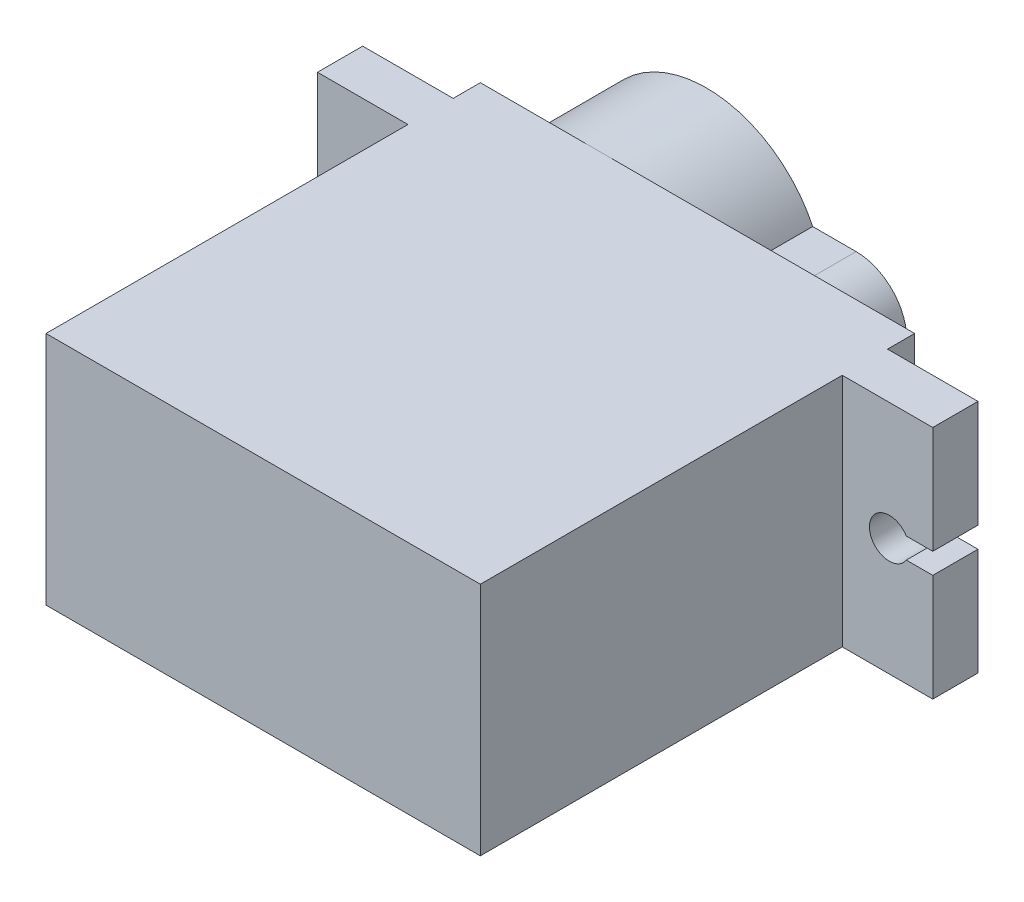
ISO-10303-21;
HEADER;
FILE_DESCRIPTION(('STEP AP214'),'2;1');
FILE_NAME('part.step','',(''),(''),'','','');
FILE_SCHEMA(('AUTOMOTIVE_DESIGN { 1 0 10303 214 1 1 1 1 }'));
ENDSEC;
DATA;
#1=APPLICATION_CONTEXT('core data for automotive mechanical design processes');
#2=APPLICATION_PROTOCOL_DEFINITION('international standard','automotive_design',2000,#1);
#3=PRODUCT_CONTEXT('',#1,'mechanical');
#4=PRODUCT('Part','Part','',(#3));
#5=PRODUCT_RELATED_PRODUCT_CATEGORY('part','',(#4));
#6=PRODUCT_DEFINITION_FORMATION('','',#4);
#7=PRODUCT_DEFINITION_CONTEXT('part definition',#1,'design');
#8=PRODUCT_DEFINITION('design','',#6,#7);
#9=PRODUCT_DEFINITION_SHAPE('','',#8);
#10=(LENGTH_UNIT() NAMED_UNIT(*) SI_UNIT(.MILLI.,.METRE.));
#11=(NAMED_UNIT(*) PLANE_ANGLE_UNIT() SI_UNIT($,.RADIAN.));
#12=(NAMED_UNIT(*) SI_UNIT($,.STERADIAN.) SOLID_ANGLE_UNIT());
#13=UNCERTAINTY_MEASURE_WITH_UNIT(LENGTH_MEASURE(1.E-05),#10,'distance_accuracy_value','');
#14=(GEOMETRIC_REPRESENTATION_CONTEXT(3) GLOBAL_UNCERTAINTY_ASSIGNED_CONTEXT((#13)) GLOBAL_UNIT_ASSIGNED_CONTEXT((#10,
#11,#12)) REPRESENTATION_CONTEXT('',''));
#15=CARTESIAN_POINT('',(0.,0.,0.));
#16=DIRECTION('',(0.,0.,1.));
#17=DIRECTION('',(1.,0.,0.));
#18=AXIS2_PLACEMENT_3D('',#15,#16,#17);
#19=CARTESIAN_POINT('',(0.,0.,0.));
#20=DIRECTION('',(0.,0.,-1.));
#21=DIRECTION('',(-1.,0.,0.));
#22=AXIS2_PLACEMENT_3D('',#19,#20,#21);
#23=PLANE('',#22);
#24=CARTESIAN_POINT('',(6.5,6.5,0.));
#25=DIRECTION('',(0.,0.,-1.));
#26=DIRECTION('',(-1.,0.,0.));
#27=AXIS2_PLACEMENT_3D('',#24,#25,#26);
#28=CIRCLE('',#27,6.5);
#29=CARTESIAN_POINT('',(0.,6.5,0.));
#30=VERTEX_POINT('',#29);
#31=CARTESIAN_POINT('',(6.5,13.,0.));
#32=VERTEX_POINT('',#31);
#33=EDGE_CURVE('E11',#30,#32,#28,.T.);
#34=ORIENTED_EDGE('',*,*,#33,.F.);
#35=DIRECTION('',(0.,-1.,0.));
#36=VECTOR('',#35,1.);
#37=CARTESIAN_POINT('',(0.,0.,0.));
#38=LINE('',#37,#36);
#39=CARTESIAN_POINT('',(0.,13.,0.));
#40=VERTEX_POINT('',#39);
#41=EDGE_CURVE('E436',#40,#30,#38,.T.);
#42=ORIENTED_EDGE('',*,*,#41,.F.);
#43=DIRECTION('',(-1.,0.,0.));
#44=VECTOR('',#43,1.);
#45=CARTESIAN_POINT('',(0.,13.,0.));
#46=LINE('',#45,#44);
#47=EDGE_CURVE('E449',#32,#40,#46,.T.);
#48=ORIENTED_EDGE('',*,*,#47,.F.);
#49=EDGE_LOOP('',(#34,#42,#48));
#50=FACE_BOUND('',#49,.T.);
#51=ADVANCED_FACE('F39',(#50),#23,.T.);
#52=CARTESIAN_POINT('',(12.366003750425,9.30000000000001,0.));
#53=VERTEX_POINT('',#52);
#54=EDGE_CURVE('E49',#32,#53,#28,.T.);
#55=ORIENTED_EDGE('',*,*,#54,.F.);
#56=CARTESIAN_POINT('',(24.,13.,0.));
#57=VERTEX_POINT('',#56);
#58=EDGE_CURVE('E426',#57,#32,#46,.T.);
#59=ORIENTED_EDGE('',*,*,#58,.F.);
#60=DIRECTION('',(0.,1.,0.));
#61=VECTOR('',#60,1.);
#62=CARTESIAN_POINT('',(24.,0.,0.));
#63=LINE('',#62,#61);
#64=CARTESIAN_POINT('',(24.,0.,0.));
#65=VERTEX_POINT('',#64);
#66=EDGE_CURVE('E445',#65,#57,#63,.T.);
#67=ORIENTED_EDGE('',*,*,#66,.F.);
#68=DIRECTION('',(1.,0.,0.));
#69=VECTOR('',#68,1.);
#70=CARTESIAN_POINT('',(0.,0.,0.));
#71=LINE('',#70,#69);
#72=CARTESIAN_POINT('',(6.5,0.,0.));
#73=VERTEX_POINT('',#72);
#74=EDGE_CURVE('E440',#73,#65,#71,.T.);
#75=ORIENTED_EDGE('',*,*,#74,.F.);
#76=CARTESIAN_POINT('',(12.366003750425,3.7,0.));
#77=VERTEX_POINT('',#76);
#78=EDGE_CURVE('E51',#77,#73,#28,.T.);
#79=ORIENTED_EDGE('',*,*,#78,.F.);
#80=DIRECTION('',(-1.,0.,0.));
#81=VECTOR('',#80,1.);
#82=CARTESIAN_POINT('',(14.7658073053947,3.7,0.));
#83=LINE('',#82,#81);
#84=CARTESIAN_POINT('',(14.7658073053947,3.7,0.));
#85=VERTEX_POINT('',#84);
#86=EDGE_CURVE('E486',#85,#77,#83,.T.);
#87=ORIENTED_EDGE('',*,*,#86,.F.);
#88=CARTESIAN_POINT('',(14.7658073053947,6.5,0.));
#89=DIRECTION('',(0.,0.,-1.));
#90=DIRECTION('',(-1.,0.,0.));
#91=AXIS2_PLACEMENT_3D('',#88,#89,#90);
#92=CIRCLE('',#91,2.8);
#93=CARTESIAN_POINT('',(14.7658073053947,9.3,0.));
#94=VERTEX_POINT('',#93);
#95=EDGE_CURVE('E63',#94,#85,#92,.T.);
#96=ORIENTED_EDGE('',*,*,#95,.F.);
#97=DIRECTION('',(1.,0.,0.));
#98=VECTOR('',#97,1.);
#99=CARTESIAN_POINT('',(12.366003750425,9.3,0.));
#100=LINE('',#99,#98);
#101=EDGE_CURVE('E58',#53,#94,#100,.T.);
#102=ORIENTED_EDGE('',*,*,#101,.F.);
#103=EDGE_LOOP('',(#55,#59,#67,#75,#79,#87,#96,#102));
#104=FACE_BOUND('',#103,.T.);
#105=ADVANCED_FACE('F524',(#104),#23,.T.);
#106=CARTESIAN_POINT('',(29.,13.,4.));
#107=DIRECTION('',(-1.,0.,0.));
#108=DIRECTION('',(0.,0.,1.));
#109=AXIS2_PLACEMENT_3D('',#106,#107,#108);
#110=PLANE('',#109);
#111=DIRECTION('',(0.,0.,-1.));
#112=VECTOR('',#111,1.);
#113=CARTESIAN_POINT('',(29.,7.07476473315433,5.));
#114=LINE('',#113,#112);
#115=CARTESIAN_POINT('',(29.,7.07476473315433,4.));
#116=VERTEX_POINT('',#115);
#117=CARTESIAN_POINT('',(29.,7.07476473315433,1.5));
#118=VERTEX_POINT('',#117);
#119=EDGE_CURVE('E275',#116,#118,#114,.T.);
#120=ORIENTED_EDGE('',*,*,#119,.T.);
#121=DIRECTION('',(0.,1.,0.));
#122=VECTOR('',#121,1.);
#123=CARTESIAN_POINT('',(29.,13.,1.5));
#124=LINE('',#123,#122);
#125=CARTESIAN_POINT('',(29.,13.,1.5));
#126=VERTEX_POINT('',#125);
#127=EDGE_CURVE('E381',#118,#126,#124,.T.);
#128=ORIENTED_EDGE('',*,*,#127,.T.);
#129=DIRECTION('',(0.,0.,-1.));
#130=VECTOR('',#129,1.);
#131=CARTESIAN_POINT('',(29.,13.,4.));
#132=LINE('',#131,#130);
#133=CARTESIAN_POINT('',(29.,13.,4.));
#134=VERTEX_POINT('',#133);
#135=EDGE_CURVE('E394',#134,#126,#132,.T.);
#136=ORIENTED_EDGE('',*,*,#135,.F.);
#137=DIRECTION('',(0.,1.,0.));
#138=VECTOR('',#137,1.);
#139=CARTESIAN_POINT('',(29.,13.,4.));
#140=LINE('',#139,#138);
#141=EDGE_CURVE('E361',#116,#134,#140,.T.);
#142=ORIENTED_EDGE('',*,*,#141,.F.);
#143=EDGE_LOOP('',(#120,#128,#136,#142));
#144=FACE_BOUND('',#143,.T.);
#145=ADVANCED_FACE('F531',(#144),#110,.F.);
#146=CARTESIAN_POINT('',(0.,0.,4.));
#147=DIRECTION('',(0.,0.,1.));
#148=DIRECTION('',(1.,0.,0.));
#149=AXIS2_PLACEMENT_3D('',#146,#147,#148);
#150=PLANE('',#149);
#151=CARTESIAN_POINT('',(-2.6,6.5,4.));
#152=DIRECTION('',(0.,0.,1.));
#153=DIRECTION('',(1.,0.,0.));
#154=AXIS2_PLACEMENT_3D('',#151,#152,#153);
#155=CIRCLE('',#154,1.1);
#156=CARTESIAN_POINT('',(-3.53789418460828,7.07476473315433,4.));
#157=VERTEX_POINT('',#156);
#158=CARTESIAN_POINT('',(-3.53789418460829,5.92523526684567,4.));
#159=VERTEX_POINT('',#158);
#160=EDGE_CURVE('E304',#157,#159,#155,.F.);
#161=ORIENTED_EDGE('',*,*,#160,.T.);
#162=DIRECTION('',(-1.,0.,0.));
#163=VECTOR('',#162,1.);
#164=CARTESIAN_POINT('',(0.,5.92523526684567,4.));
#165=LINE('',#164,#163);
#166=CARTESIAN_POINT('',(-5.,5.92523526684567,4.));
#167=VERTEX_POINT('',#166);
#168=EDGE_CURVE('E300',#159,#167,#165,.T.);
#169=ORIENTED_EDGE('',*,*,#168,.T.);
#170=DIRECTION('',(0.,-1.,0.));
#171=VECTOR('',#170,1.);
#172=CARTESIAN_POINT('',(-5.00000000000001,13.,4.));
#173=LINE('',#172,#171);
#174=CARTESIAN_POINT('',(-5.,0.,4.));
#175=VERTEX_POINT('',#174);
#176=EDGE_CURVE('E356',#167,#175,#173,.T.);
#177=ORIENTED_EDGE('',*,*,#176,.T.);
#178=DIRECTION('',(1.,0.,0.));
#179=VECTOR('',#178,1.);
#180=CARTESIAN_POINT('',(-5.,0.,4.));
#181=LINE('',#180,#179);
#182=CARTESIAN_POINT('',(0.,0.,4.));
#183=VERTEX_POINT('',#182);
#184=EDGE_CURVE('E357',#175,#183,#181,.T.);
#185=ORIENTED_EDGE('',*,*,#184,.T.);
#186=DIRECTION('',(0.,-1.,0.));
#187=VECTOR('',#186,1.);
#188=CARTESIAN_POINT('',(0.,0.,4.));
#189=LINE('',#188,#187);
#190=CARTESIAN_POINT('',(0.,13.,4.));
#191=VERTEX_POINT('',#190);
#192=EDGE_CURVE('E417',#191,#183,#189,.T.);
#193=ORIENTED_EDGE('',*,*,#192,.F.);
#194=DIRECTION('',(-1.,0.,0.));
#195=VECTOR('',#194,1.);
#196=CARTESIAN_POINT('',(-5.00000000000001,13.,4.));
#197=LINE('',#196,#195);
#198=CARTESIAN_POINT('',(-5.00000000000001,13.,4.));
#199=VERTEX_POINT('',#198);
#200=EDGE_CURVE('E366',#191,#199,#197,.T.);
#201=ORIENTED_EDGE('',*,*,#200,.T.);
#202=CARTESIAN_POINT('',(-5.00000000000001,7.07476473315433,4.));
#203=VERTEX_POINT('',#202);
#204=EDGE_CURVE('E351',#199,#203,#173,.T.);
#205=ORIENTED_EDGE('',*,*,#204,.T.);
#206=DIRECTION('',(-1.,0.,0.));
#207=VECTOR('',#206,1.);
#208=CARTESIAN_POINT('',(0.,7.07476473315433,4.));
#209=LINE('',#208,#207);
#210=EDGE_CURVE('E274',#157,#203,#209,.T.);
#211=ORIENTED_EDGE('',*,*,#210,.F.);
#212=EDGE_LOOP('',(#161,#169,#177,#185,#193,#201,#205,#211));
#213=FACE_BOUND('',#212,.T.);
#214=ADVANCED_FACE('F587',(#213),#150,.T.);
#215=CARTESIAN_POINT('',(0.,0.,1.5));
#216=DIRECTION('',(0.,0.,1.));
#217=DIRECTION('',(1.,0.,0.));
#218=AXIS2_PLACEMENT_3D('',#215,#216,#217);
#219=PLANE('',#218);
#220=CARTESIAN_POINT('',(-2.6,3.,1.5));
#221=DIRECTION('',(0.,0.,-1.));
#222=DIRECTION('',(-1.,0.,0.));
#223=AXIS2_PLACEMENT_3D('',#220,#221,#222);
#224=CIRCLE('',#223,1.09999999999999);
#225=CARTESIAN_POINT('',(-3.69999999999999,3.,1.5));
#226=VERTEX_POINT('',#225);
#227=EDGE_CURVE('E326',#226,#226,#224,.T.);
#228=ORIENTED_EDGE('',*,*,#227,.F.);
#229=EDGE_LOOP('',(#228));
#230=FACE_BOUND('',#229,.T.);
#231=CARTESIAN_POINT('',(-2.6,10.,1.5));
#232=DIRECTION('',(0.,0.,-1.));
#233=DIRECTION('',(-1.,0.,0.));
#234=AXIS2_PLACEMENT_3D('',#231,#232,#233);
#235=CIRCLE('',#234,1.09999999999999);
#236=CARTESIAN_POINT('',(-3.69999999999999,10.,1.5));
#237=VERTEX_POINT('',#236);
#238=EDGE_CURVE('E318',#237,#237,#235,.T.);
#239=ORIENTED_EDGE('',*,*,#238,.F.);
#240=EDGE_LOOP('',(#239));
#241=FACE_BOUND('',#240,.T.);
#242=DIRECTION('',(1.,0.,0.));
#243=VECTOR('',#242,1.);
#244=CARTESIAN_POINT('',(-5.,5.92523526684567,1.5));
#245=LINE('',#244,#243);
#246=CARTESIAN_POINT('',(-5.,5.92523526684567,1.5));
#247=VERTEX_POINT('',#246);
#248=CARTESIAN_POINT('',(-3.53789418460829,5.92523526684567,1.5));
#249=VERTEX_POINT('',#248);
#250=EDGE_CURVE('E262',#247,#249,#245,.T.);
#251=ORIENTED_EDGE('',*,*,#250,.T.);
#252=CARTESIAN_POINT('',(-2.6,6.5,1.5));
#253=DIRECTION('',(0.,0.,1.));
#254=DIRECTION('',(1.,0.,0.));
#255=AXIS2_PLACEMENT_3D('',#252,#253,#254);
#256=CIRCLE('',#255,1.1);
#257=CARTESIAN_POINT('',(-3.53789418460828,7.07476473315433,1.5));
#258=VERTEX_POINT('',#257);
#259=EDGE_CURVE('E291',#249,#258,#256,.T.);
#260=ORIENTED_EDGE('',*,*,#259,.T.);
#261=DIRECTION('',(1.,0.,0.));
#262=VECTOR('',#261,1.);
#263=CARTESIAN_POINT('',(-5.,7.07476473315433,1.5));
#264=LINE('',#263,#262);
#265=CARTESIAN_POINT('',(-5.,7.07476473315433,1.5));
#266=VERTEX_POINT('',#265);
#267=EDGE_CURVE('E287',#266,#258,#264,.T.);
#268=ORIENTED_EDGE('',*,*,#267,.F.);
#269=DIRECTION('',(0.,-1.,0.));
#270=VECTOR('',#269,1.);
#271=CARTESIAN_POINT('',(-5.00000000000001,13.,1.5));
#272=LINE('',#271,#270);
#273=CARTESIAN_POINT('',(-5.00000000000001,13.,1.5));
#274=VERTEX_POINT('',#273);
#275=EDGE_CURVE('E372',#274,#266,#272,.T.);
#276=ORIENTED_EDGE('',*,*,#275,.F.);
#277=DIRECTION('',(-1.,0.,0.));
#278=VECTOR('',#277,1.);
#279=CARTESIAN_POINT('',(-5.00000000000001,13.,1.5));
#280=LINE('',#279,#278);
#281=CARTESIAN_POINT('',(0.,13.,1.5));
#282=VERTEX_POINT('',#281);
#283=EDGE_CURVE('E386',#282,#274,#280,.T.);
#284=ORIENTED_EDGE('',*,*,#283,.F.);
#285=DIRECTION('',(0.,-1.,0.));
#286=VECTOR('',#285,1.);
#287=CARTESIAN_POINT('',(0.,0.,1.5));
#288=LINE('',#287,#286);
#289=CARTESIAN_POINT('',(0.,0.,1.5));
#290=VERTEX_POINT('',#289);
#291=EDGE_CURVE('E410',#282,#290,#288,.T.);
#292=ORIENTED_EDGE('',*,*,#291,.T.);
#293=DIRECTION('',(1.,0.,0.));
#294=VECTOR('',#293,1.);
#295=CARTESIAN_POINT('',(-5.,0.,1.5));
#296=LINE('',#295,#294);
#297=CARTESIAN_POINT('',(-5.,0.,1.5));
#298=VERTEX_POINT('',#297);
#299=EDGE_CURVE('E377',#298,#290,#296,.T.);
#300=ORIENTED_EDGE('',*,*,#299,.F.);
#301=EDGE_CURVE('E350',#247,#298,#272,.T.);
#302=ORIENTED_EDGE('',*,*,#301,.F.);
#303=EDGE_LOOP('',(#251,#260,#268,#276,#284,#292,#300,#302));
#304=FACE_BOUND('',#303,.T.);
#305=ADVANCED_FACE('F581',(#230,#241,#304),#219,.F.);
#306=CARTESIAN_POINT('',(-5.00000000000001,13.,4.));
#307=DIRECTION('',(1.,0.,0.));
#308=DIRECTION('',(0.,1.,0.));
#309=AXIS2_PLACEMENT_3D('',#306,#307,#308);
#310=PLANE('',#309);
#311=DIRECTION('',(0.,0.,1.));
#312=VECTOR('',#311,1.);
#313=CARTESIAN_POINT('',(-5.,5.92523526684567,4.));
#314=LINE('',#313,#312);
#315=EDGE_CURVE('E43',#247,#167,#314,.T.);
#316=ORIENTED_EDGE('',*,*,#315,.F.);
#317=ORIENTED_EDGE('',*,*,#301,.T.);
#318=DIRECTION('',(0.,0.,-1.));
#319=VECTOR('',#318,1.);
#320=CARTESIAN_POINT('',(-5.,0.,4.));
#321=LINE('',#320,#319);
#322=EDGE_CURVE('E402',#175,#298,#321,.T.);
#323=ORIENTED_EDGE('',*,*,#322,.F.);
#324=ORIENTED_EDGE('',*,*,#176,.F.);
#325=EDGE_LOOP('',(#316,#317,#323,#324));
#326=FACE_BOUND('',#325,.T.);
#327=ADVANCED_FACE('F578',(#326),#310,.F.);
#328=CARTESIAN_POINT('',(0.,0.,24.));
#329=DIRECTION('',(1.,0.,0.));
#330=DIRECTION('',(0.,0.,-1.));
#331=AXIS2_PLACEMENT_3D('',#328,#329,#330);
#332=PLANE('',#331);
#333=ORIENTED_EDGE('',*,*,#291,.F.);
#334=DIRECTION('',(0.,0.,-1.));
#335=VECTOR('',#334,1.);
#336=CARTESIAN_POINT('',(0.,13.,24.));
#337=LINE('',#336,#335);
#338=EDGE_CURVE('E435',#282,#40,#337,.T.);
#339=ORIENTED_EDGE('',*,*,#338,.T.);
#340=ORIENTED_EDGE('',*,*,#41,.T.);
#341=CARTESIAN_POINT('',(0.,0.,0.));
#342=VERTEX_POINT('',#341);
#343=EDGE_CURVE('E420',#30,#342,#38,.T.);
#344=ORIENTED_EDGE('',*,*,#343,.T.);
#345=DIRECTION('',(0.,0.,-1.));
#346=VECTOR('',#345,1.);
#347=CARTESIAN_POINT('',(0.,0.,24.));
#348=LINE('',#347,#346);
#349=EDGE_CURVE('E465',#290,#342,#348,.T.);
#350=ORIENTED_EDGE('',*,*,#349,.F.);
#351=EDGE_LOOP('',(#333,#339,#340,#344,#350));
#352=FACE_BOUND('',#351,.T.);
#353=ADVANCED_FACE('F606',(#352),#332,.F.);
#354=CARTESIAN_POINT('',(24.,0.,24.));
#355=DIRECTION('',(-1.,0.,0.));
#356=DIRECTION('',(0.,0.,1.));
#357=AXIS2_PLACEMENT_3D('',#354,#355,#356);
#358=PLANE('',#357);
#359=DIRECTION('',(0.,1.,0.));
#360=VECTOR('',#359,1.);
#361=CARTESIAN_POINT('',(24.,0.,1.5));
#362=LINE('',#361,#360);
#363=CARTESIAN_POINT('',(24.,0.,1.5));
#364=VERTEX_POINT('',#363);
#365=CARTESIAN_POINT('',(24.,13.,1.5));
#366=VERTEX_POINT('',#365);
#367=EDGE_CURVE('E406',#364,#366,#362,.T.);
#368=ORIENTED_EDGE('',*,*,#367,.F.);
#369=DIRECTION('',(0.,0.,-1.));
#370=VECTOR('',#369,1.);
#371=CARTESIAN_POINT('',(24.,0.,24.));
#372=LINE('',#371,#370);
#373=EDGE_CURVE('E461',#364,#65,#372,.T.);
#374=ORIENTED_EDGE('',*,*,#373,.T.);
#375=ORIENTED_EDGE('',*,*,#66,.T.);
#376=DIRECTION('',(0.,0.,-1.));
#377=VECTOR('',#376,1.);
#378=CARTESIAN_POINT('',(24.,13.,24.));
#379=LINE('',#378,#377);
#380=EDGE_CURVE('E456',#366,#57,#379,.T.);
#381=ORIENTED_EDGE('',*,*,#380,.F.);
#382=EDGE_LOOP('',(#368,#374,#375,#381));
#383=FACE_BOUND('',#382,.T.);
#384=ADVANCED_FACE('F614',(#383),#358,.F.);
#385=CARTESIAN_POINT('',(0.,13.,24.));
#386=VERTEX_POINT('',#385);
#387=EDGE_CURVE('E453',#386,#191,#337,.T.);
#388=ORIENTED_EDGE('',*,*,#387,.T.);
#389=ORIENTED_EDGE('',*,*,#192,.T.);
#390=CARTESIAN_POINT('',(0.,0.,24.));
#391=VERTEX_POINT('',#390);
#392=EDGE_CURVE('E466',#391,#183,#348,.T.);
#393=ORIENTED_EDGE('',*,*,#392,.F.);
#394=DIRECTION('',(0.,-1.,0.));
#395=VECTOR('',#394,1.);
#396=CARTESIAN_POINT('',(0.,0.,24.));
#397=LINE('',#396,#395);
#398=EDGE_CURVE('E421',#386,#391,#397,.T.);
#399=ORIENTED_EDGE('',*,*,#398,.F.);
#400=EDGE_LOOP('',(#388,#389,#393,#399));
#401=FACE_BOUND('',#400,.T.);
#402=ADVANCED_FACE('F41',(#401),#332,.F.);
#403=CARTESIAN_POINT('',(0.,0.,24.));
#404=DIRECTION('',(0.,1.,0.));
#405=DIRECTION('',(0.,0.,1.));
#406=AXIS2_PLACEMENT_3D('',#403,#404,#405);
#407=PLANE('',#406);
#408=ORIENTED_EDGE('',*,*,#392,.T.);
#409=ORIENTED_EDGE('',*,*,#184,.F.);
#410=ORIENTED_EDGE('',*,*,#322,.T.);
#411=ORIENTED_EDGE('',*,*,#299,.T.);
#412=ORIENTED_EDGE('',*,*,#349,.T.);
#413=EDGE_CURVE('E441',#342,#73,#71,.T.);
#414=ORIENTED_EDGE('',*,*,#413,.T.);
#415=ORIENTED_EDGE('',*,*,#74,.T.);
#416=ORIENTED_EDGE('',*,*,#373,.F.);
#417=CARTESIAN_POINT('',(29.,0.,1.5));
#418=VERTEX_POINT('',#417);
#419=EDGE_CURVE('E376',#364,#418,#296,.T.);
#420=ORIENTED_EDGE('',*,*,#419,.T.);
#421=DIRECTION('',(0.,0.,-1.));
#422=VECTOR('',#421,1.);
#423=CARTESIAN_POINT('',(29.,0.,4.));
#424=LINE('',#423,#422);
#425=CARTESIAN_POINT('',(29.,0.,4.));
#426=VERTEX_POINT('',#425);
#427=EDGE_CURVE('E398',#426,#418,#424,.T.);
#428=ORIENTED_EDGE('',*,*,#427,.F.);
#429=CARTESIAN_POINT('',(24.,0.,4.));
#430=VERTEX_POINT('',#429);
#431=EDGE_CURVE('E355',#430,#426,#181,.T.);
#432=ORIENTED_EDGE('',*,*,#431,.F.);
#433=CARTESIAN_POINT('',(24.,0.,24.));
#434=VERTEX_POINT('',#433);
#435=EDGE_CURVE('E462',#434,#430,#372,.T.);
#436=ORIENTED_EDGE('',*,*,#435,.F.);
#437=DIRECTION('',(1.,0.,0.));
#438=VECTOR('',#437,1.);
#439=CARTESIAN_POINT('',(0.,0.,24.));
#440=LINE('',#439,#438);
#441=EDGE_CURVE('E425',#391,#434,#440,.T.);
#442=ORIENTED_EDGE('',*,*,#441,.F.);
#443=EDGE_LOOP('',(#408,#409,#410,#411,#412,#414,#415,#416,#420,#428,#432,#436,#442));
#444=FACE_BOUND('',#443,.T.);
#445=ADVANCED_FACE('F557',(#444),#407,.F.);
#446=ORIENTED_EDGE('',*,*,#435,.T.);
#447=DIRECTION('',(0.,1.,0.));
#448=VECTOR('',#447,1.);
#449=CARTESIAN_POINT('',(24.,0.,4.));
#450=LINE('',#449,#448);
#451=CARTESIAN_POINT('',(24.,13.,4.));
#452=VERTEX_POINT('',#451);
#453=EDGE_CURVE('E414',#430,#452,#450,.T.);
#454=ORIENTED_EDGE('',*,*,#453,.T.);
#455=CARTESIAN_POINT('',(24.,13.,24.));
#456=VERTEX_POINT('',#455);
#457=EDGE_CURVE('E457',#456,#452,#379,.T.);
#458=ORIENTED_EDGE('',*,*,#457,.F.);
#459=DIRECTION('',(0.,1.,0.));
#460=VECTOR('',#459,1.);
#461=CARTESIAN_POINT('',(24.,0.,24.));
#462=LINE('',#461,#460);
#463=EDGE_CURVE('E429',#434,#456,#462,.T.);
#464=ORIENTED_EDGE('',*,*,#463,.F.);
#465=EDGE_LOOP('',(#446,#454,#458,#464));
#466=FACE_BOUND('',#465,.T.);
#467=ADVANCED_FACE('F634',(#466),#358,.F.);
#468=CARTESIAN_POINT('',(0.,13.,24.));
#469=DIRECTION('',(0.,-1.,0.));
#470=DIRECTION('',(0.,0.,-1.));
#471=AXIS2_PLACEMENT_3D('',#468,#469,#470);
#472=PLANE('',#471);
#473=ORIENTED_EDGE('',*,*,#457,.T.);
#474=EDGE_CURVE('E367',#134,#452,#197,.T.);
#475=ORIENTED_EDGE('',*,*,#474,.F.);
#476=ORIENTED_EDGE('',*,*,#135,.T.);
#477=EDGE_CURVE('E387',#126,#366,#280,.T.);
#478=ORIENTED_EDGE('',*,*,#477,.T.);
#479=ORIENTED_EDGE('',*,*,#380,.T.);
#480=ORIENTED_EDGE('',*,*,#58,.T.);
#481=ORIENTED_EDGE('',*,*,#47,.T.);
#482=ORIENTED_EDGE('',*,*,#338,.F.);
#483=ORIENTED_EDGE('',*,*,#283,.T.);
#484=DIRECTION('',(0.,0.,-1.));
#485=VECTOR('',#484,1.);
#486=CARTESIAN_POINT('',(-5.00000000000001,13.,4.));
#487=LINE('',#486,#485);
#488=EDGE_CURVE('E371',#199,#274,#487,.T.);
#489=ORIENTED_EDGE('',*,*,#488,.F.);
#490=ORIENTED_EDGE('',*,*,#200,.F.);
#491=ORIENTED_EDGE('',*,*,#387,.F.);
#492=DIRECTION('',(-1.,0.,0.));
#493=VECTOR('',#492,1.);
#494=CARTESIAN_POINT('',(0.,13.,24.));
#495=LINE('',#494,#493);
#496=EDGE_CURVE('E432',#456,#386,#495,.T.);
#497=ORIENTED_EDGE('',*,*,#496,.F.);
#498=EDGE_LOOP('',(#473,#475,#476,#478,#479,#480,#481,#482,#483,#489,#490,#491,#497));
#499=FACE_BOUND('',#498,.T.);
#500=ADVANCED_FACE('F545',(#499),#472,.F.);
#501=CARTESIAN_POINT('',(0.,0.,24.));
#502=DIRECTION('',(0.,0.,-1.));
#503=DIRECTION('',(-1.,0.,0.));
#504=AXIS2_PLACEMENT_3D('',#501,#502,#503);
#505=PLANE('',#504);
#506=ORIENTED_EDGE('',*,*,#398,.T.);
#507=ORIENTED_EDGE('',*,*,#441,.T.);
#508=ORIENTED_EDGE('',*,*,#463,.T.);
#509=ORIENTED_EDGE('',*,*,#496,.T.);
#510=EDGE_LOOP('',(#506,#507,#508,#509));
#511=FACE_BOUND('',#510,.T.);
#512=ADVANCED_FACE('F536',(#511),#505,.F.);
#513=EDGE_CURVE('E475',#73,#30,#28,.T.);
#514=ORIENTED_EDGE('',*,*,#513,.F.);
#515=ORIENTED_EDGE('',*,*,#413,.F.);
#516=ORIENTED_EDGE('',*,*,#343,.F.);
#517=EDGE_LOOP('',(#514,#515,#516));
#518=FACE_BOUND('',#517,.T.);
#519=ADVANCED_FACE('F527',(#518),#23,.T.);
#520=CARTESIAN_POINT('',(29.,5.92523526684567,1.5));
#521=VERTEX_POINT('',#520);
#522=EDGE_CURVE('E382',#418,#521,#124,.T.);
#523=ORIENTED_EDGE('',*,*,#522,.T.);
#524=DIRECTION('',(0.,0.,-1.));
#525=VECTOR('',#524,1.);
#526=CARTESIAN_POINT('',(29.,5.92523526684567,5.));
#527=LINE('',#526,#525);
#528=CARTESIAN_POINT('',(29.,5.92523526684567,4.));
#529=VERTEX_POINT('',#528);
#530=EDGE_CURVE('E271',#529,#521,#527,.T.);
#531=ORIENTED_EDGE('',*,*,#530,.F.);
#532=EDGE_CURVE('E362',#426,#529,#140,.T.);
#533=ORIENTED_EDGE('',*,*,#532,.F.);
#534=ORIENTED_EDGE('',*,*,#427,.T.);
#535=EDGE_LOOP('',(#523,#531,#533,#534));
#536=FACE_BOUND('',#535,.T.);
#537=ADVANCED_FACE('F535',(#536),#110,.F.);
#538=DIRECTION('',(1.,0.,0.));
#539=VECTOR('',#538,1.);
#540=CARTESIAN_POINT('',(0.,5.92523526684567,4.));
#541=LINE('',#540,#539);
#542=CARTESIAN_POINT('',(27.5378941846083,5.92523526684567,4.));
#543=VERTEX_POINT('',#542);
#544=EDGE_CURVE('E315',#543,#529,#541,.T.);
#545=ORIENTED_EDGE('',*,*,#544,.F.);
#546=CARTESIAN_POINT('',(26.6,6.5,4.));
#547=DIRECTION('',(0.,0.,1.));
#548=DIRECTION('',(1.,0.,0.));
#549=AXIS2_PLACEMENT_3D('',#546,#547,#548);
#550=CIRCLE('',#549,1.1);
#551=CARTESIAN_POINT('',(27.5378941846083,7.07476473315433,4.));
#552=VERTEX_POINT('',#551);
#553=EDGE_CURVE('E308',#552,#543,#550,.T.);
#554=ORIENTED_EDGE('',*,*,#553,.F.);
#555=DIRECTION('',(1.,0.,0.));
#556=VECTOR('',#555,1.);
#557=CARTESIAN_POINT('',(0.,7.07476473315435,4.));
#558=LINE('',#557,#556);
#559=EDGE_CURVE('E311',#552,#116,#558,.T.);
#560=ORIENTED_EDGE('',*,*,#559,.T.);
#561=ORIENTED_EDGE('',*,*,#141,.T.);
#562=ORIENTED_EDGE('',*,*,#474,.T.);
#563=ORIENTED_EDGE('',*,*,#453,.F.);
#564=ORIENTED_EDGE('',*,*,#431,.T.);
#565=ORIENTED_EDGE('',*,*,#532,.T.);
#566=EDGE_LOOP('',(#545,#554,#560,#561,#562,#563,#564,#565));
#567=FACE_BOUND('',#566,.T.);
#568=ADVANCED_FACE('F542',(#567),#150,.T.);
#569=CARTESIAN_POINT('',(26.6,6.5,1.5));
#570=DIRECTION('',(0.,0.,-1.));
#571=DIRECTION('',(-1.,0.,0.));
#572=AXIS2_PLACEMENT_3D('',#569,#570,#571);
#573=CIRCLE('',#572,1.1);
#574=CARTESIAN_POINT('',(27.5378941846083,5.92523526684567,1.5));
#575=VERTEX_POINT('',#574);
#576=CARTESIAN_POINT('',(27.5378941846083,7.07476473315433,1.5));
#577=VERTEX_POINT('',#576);
#578=EDGE_CURVE('E261',#575,#577,#573,.T.);
#579=ORIENTED_EDGE('',*,*,#578,.F.);
#580=DIRECTION('',(-1.,0.,0.));
#581=VECTOR('',#580,1.);
#582=CARTESIAN_POINT('',(29.,5.92523526684567,1.5));
#583=LINE('',#582,#581);
#584=EDGE_CURVE('E258',#521,#575,#583,.T.);
#585=ORIENTED_EDGE('',*,*,#584,.F.);
#586=ORIENTED_EDGE('',*,*,#522,.F.);
#587=ORIENTED_EDGE('',*,*,#419,.F.);
#588=ORIENTED_EDGE('',*,*,#367,.T.);
#589=ORIENTED_EDGE('',*,*,#477,.F.);
#590=ORIENTED_EDGE('',*,*,#127,.F.);
#591=DIRECTION('',(-1.,0.,0.));
#592=VECTOR('',#591,1.);
#593=CARTESIAN_POINT('',(29.,7.07476473315433,1.5));
#594=LINE('',#593,#592);
#595=EDGE_CURVE('E266',#118,#577,#594,.T.);
#596=ORIENTED_EDGE('',*,*,#595,.T.);
#597=EDGE_LOOP('',(#579,#585,#586,#587,#588,#589,#590,#596));
#598=FACE_BOUND('',#597,.T.);
#599=CARTESIAN_POINT('',(26.6,10.,1.5));
#600=DIRECTION('',(0.,0.,-1.));
#601=DIRECTION('',(-1.,0.,0.));
#602=AXIS2_PLACEMENT_3D('',#599,#600,#601);
#603=CIRCLE('',#602,1.09999999999999);
#604=CARTESIAN_POINT('',(25.5,10.,1.5));
#605=VERTEX_POINT('',#604);
#606=EDGE_CURVE('E334',#605,#605,#603,.T.);
#607=ORIENTED_EDGE('',*,*,#606,.F.);
#608=EDGE_LOOP('',(#607));
#609=FACE_BOUND('',#608,.T.);
#610=CARTESIAN_POINT('',(26.6,3.,1.5));
#611=DIRECTION('',(0.,0.,-1.));
#612=DIRECTION('',(-1.,0.,0.));
#613=AXIS2_PLACEMENT_3D('',#610,#611,#612);
#614=CIRCLE('',#613,1.09999999999999);
#615=CARTESIAN_POINT('',(25.5,3.,1.5));
#616=VERTEX_POINT('',#615);
#617=EDGE_CURVE('E342',#616,#616,#614,.T.);
#618=ORIENTED_EDGE('',*,*,#617,.F.);
#619=EDGE_LOOP('',(#618));
#620=FACE_BOUND('',#619,.T.);
#621=ADVANCED_FACE('F620',(#598,#609,#620),#219,.F.);
#622=ORIENTED_EDGE('',*,*,#275,.T.);
#623=DIRECTION('',(0.,0.,1.));
#624=VECTOR('',#623,1.);
#625=CARTESIAN_POINT('',(-5.00000000000001,7.07476473315433,4.));
#626=LINE('',#625,#624);
#627=EDGE_CURVE('E469',#266,#203,#626,.T.);
#628=ORIENTED_EDGE('',*,*,#627,.T.);
#629=ORIENTED_EDGE('',*,*,#204,.F.);
#630=ORIENTED_EDGE('',*,*,#488,.T.);
#631=EDGE_LOOP('',(#622,#628,#629,#630));
#632=FACE_BOUND('',#631,.T.);
#633=ADVANCED_FACE('F599',(#632),#310,.F.);
#634=CARTESIAN_POINT('',(26.6,3.,2.57699040570499));
#635=DIRECTION('',(0.,0.,-1.));
#636=DIRECTION('',(-1.,0.,0.));
#637=AXIS2_PLACEMENT_3D('',#634,#635,#636);
#638=CONICAL_SURFACE('',#637,1.1,0.872664625997165);
#639=CARTESIAN_POINT('',(26.6,3.,3.5));
#640=VERTEX_POINT('',#639);
#641=VERTEX_LOOP('',#640);
#642=FACE_BOUND('',#641,.T.);
#643=CARTESIAN_POINT('',(26.6,3.,2.57699040570499));
#644=DIRECTION('',(0.,0.,-1.));
#645=DIRECTION('',(-1.,0.,0.));
#646=AXIS2_PLACEMENT_3D('',#643,#644,#645);
#647=CIRCLE('',#646,1.1);
#648=CARTESIAN_POINT('',(25.5,3.,2.57699040570499));
#649=VERTEX_POINT('',#648);
#650=EDGE_CURVE('E346',#649,#649,#647,.T.);
#651=ORIENTED_EDGE('',*,*,#650,.T.);
#652=EDGE_LOOP('',(#651));
#653=FACE_BOUND('',#652,.T.);
#654=ADVANCED_FACE('F655',(#642,#653),#638,.F.);
#655=CARTESIAN_POINT('',(26.6,3.,1.5));
#656=DIRECTION('',(0.,0.,-1.));
#657=DIRECTION('',(-1.,0.,0.));
#658=AXIS2_PLACEMENT_3D('',#655,#656,#657);
#659=CYLINDRICAL_SURFACE('',#658,1.09999999999999);
#660=ORIENTED_EDGE('',*,*,#650,.F.);
#661=EDGE_LOOP('',(#660));
#662=FACE_BOUND('',#661,.T.);
#663=ORIENTED_EDGE('',*,*,#617,.T.);
#664=EDGE_LOOP('',(#663));
#665=FACE_BOUND('',#664,.T.);
#666=ADVANCED_FACE('F660',(#662,#665),#659,.F.);
#667=CARTESIAN_POINT('',(26.6,10.,2.57699040570499));
#668=DIRECTION('',(0.,0.,-1.));
#669=DIRECTION('',(-1.,0.,0.));
#670=AXIS2_PLACEMENT_3D('',#667,#668,#669);
#671=CONICAL_SURFACE('',#670,1.1,0.872664625997165);
#672=CARTESIAN_POINT('',(26.6,10.,3.5));
#673=VERTEX_POINT('',#672);
#674=VERTEX_LOOP('',#673);
#675=FACE_BOUND('',#674,.T.);
#676=CARTESIAN_POINT('',(26.6,10.,2.57699040570499));
#677=DIRECTION('',(0.,0.,-1.));
#678=DIRECTION('',(-1.,0.,0.));
#679=AXIS2_PLACEMENT_3D('',#676,#677,#678);
#680=CIRCLE('',#679,1.1);
#681=CARTESIAN_POINT('',(25.5,10.,2.57699040570499));
#682=VERTEX_POINT('',#681);
#683=EDGE_CURVE('E338',#682,#682,#680,.T.);
#684=ORIENTED_EDGE('',*,*,#683,.T.);
#685=EDGE_LOOP('',(#684));
#686=FACE_BOUND('',#685,.T.);
#687=ADVANCED_FACE('F671',(#675,#686),#671,.F.);
#688=CARTESIAN_POINT('',(26.6,10.,1.5));
#689=DIRECTION('',(0.,0.,-1.));
#690=DIRECTION('',(-1.,0.,0.));
#691=AXIS2_PLACEMENT_3D('',#688,#689,#690);
#692=CYLINDRICAL_SURFACE('',#691,1.09999999999999);
#693=ORIENTED_EDGE('',*,*,#683,.F.);
#694=EDGE_LOOP('',(#693));
#695=FACE_BOUND('',#694,.T.);
#696=ORIENTED_EDGE('',*,*,#606,.T.);
#697=EDGE_LOOP('',(#696));
#698=FACE_BOUND('',#697,.T.);
#699=ADVANCED_FACE('F675',(#695,#698),#692,.F.);
#700=CARTESIAN_POINT('',(-2.6,3.,2.57699040570499));
#701=DIRECTION('',(0.,0.,-1.));
#702=DIRECTION('',(-1.,0.,0.));
#703=AXIS2_PLACEMENT_3D('',#700,#701,#702);
#704=CONICAL_SURFACE('',#703,1.1,0.872664625997164);
#705=CARTESIAN_POINT('',(-2.6,3.,3.5));
#706=VERTEX_POINT('',#705);
#707=VERTEX_LOOP('',#706);
#708=FACE_BOUND('',#707,.T.);
#709=CARTESIAN_POINT('',(-2.6,3.,2.57699040570499));
#710=DIRECTION('',(0.,0.,-1.));
#711=DIRECTION('',(-1.,0.,0.));
#712=AXIS2_PLACEMENT_3D('',#709,#710,#711);
#713=CIRCLE('',#712,1.1);
#714=CARTESIAN_POINT('',(-3.7,3.,2.57699040570499));
#715=VERTEX_POINT('',#714);
#716=EDGE_CURVE('E330',#715,#715,#713,.T.);
#717=ORIENTED_EDGE('',*,*,#716,.T.);
#718=EDGE_LOOP('',(#717));
#719=FACE_BOUND('',#718,.T.);
#720=ADVANCED_FACE('F679',(#708,#719),#704,.F.);
#721=CARTESIAN_POINT('',(-2.6,3.,1.5));
#722=DIRECTION('',(0.,0.,-1.));
#723=DIRECTION('',(-1.,0.,0.));
#724=AXIS2_PLACEMENT_3D('',#721,#722,#723);
#725=CYLINDRICAL_SURFACE('',#724,1.09999999999999);
#726=ORIENTED_EDGE('',*,*,#716,.F.);
#727=EDGE_LOOP('',(#726));
#728=FACE_BOUND('',#727,.T.);
#729=ORIENTED_EDGE('',*,*,#227,.T.);
#730=EDGE_LOOP('',(#729));
#731=FACE_BOUND('',#730,.T.);
#732=ADVANCED_FACE('F683',(#728,#731),#725,.F.);
#733=CARTESIAN_POINT('',(-2.6,10.,2.57699040570499));
#734=DIRECTION('',(0.,0.,-1.));
#735=DIRECTION('',(-1.,0.,0.));
#736=AXIS2_PLACEMENT_3D('',#733,#734,#735);
#737=CONICAL_SURFACE('',#736,1.1,0.872664625997164);
#738=CARTESIAN_POINT('',(-2.6,10.,3.5));
#739=VERTEX_POINT('',#738);
#740=VERTEX_LOOP('',#739);
#741=FACE_BOUND('',#740,.T.);
#742=CARTESIAN_POINT('',(-2.6,10.,2.57699040570499));
#743=DIRECTION('',(0.,0.,-1.));
#744=DIRECTION('',(-1.,0.,0.));
#745=AXIS2_PLACEMENT_3D('',#742,#743,#744);
#746=CIRCLE('',#745,1.1);
#747=CARTESIAN_POINT('',(-3.7,10.,2.57699040570499));
#748=VERTEX_POINT('',#747);
#749=EDGE_CURVE('E322',#748,#748,#746,.T.);
#750=ORIENTED_EDGE('',*,*,#749,.T.);
#751=EDGE_LOOP('',(#750));
#752=FACE_BOUND('',#751,.T.);
#753=ADVANCED_FACE('F687',(#741,#752),#737,.F.);
#754=CARTESIAN_POINT('',(-2.6,10.,1.5));
#755=DIRECTION('',(0.,0.,-1.));
#756=DIRECTION('',(-1.,0.,0.));
#757=AXIS2_PLACEMENT_3D('',#754,#755,#756);
#758=CYLINDRICAL_SURFACE('',#757,1.09999999999999);
#759=ORIENTED_EDGE('',*,*,#749,.F.);
#760=EDGE_LOOP('',(#759));
#761=FACE_BOUND('',#760,.T.);
#762=ORIENTED_EDGE('',*,*,#238,.T.);
#763=EDGE_LOOP('',(#762));
#764=FACE_BOUND('',#763,.T.);
#765=ADVANCED_FACE('F691',(#761,#764),#758,.F.);
#766=CARTESIAN_POINT('',(-5.,5.92523526684567,5.));
#767=DIRECTION('',(0.,1.,0.));
#768=DIRECTION('',(0.,0.,1.));
#769=AXIS2_PLACEMENT_3D('',#766,#767,#768);
#770=PLANE('',#769);
#771=DIRECTION('',(0.,0.,-1.));
#772=VECTOR('',#771,1.);
#773=CARTESIAN_POINT('',(-3.53789418460829,5.92523526684567,5.));
#774=LINE('',#773,#772);
#775=EDGE_CURVE('E248',#159,#249,#774,.T.);
#776=ORIENTED_EDGE('',*,*,#775,.T.);
#777=ORIENTED_EDGE('',*,*,#250,.F.);
#778=ORIENTED_EDGE('',*,*,#315,.T.);
#779=ORIENTED_EDGE('',*,*,#168,.F.);
#780=EDGE_LOOP('',(#776,#777,#778,#779));
#781=FACE_BOUND('',#780,.T.);
#782=ADVANCED_FACE('F591',(#781),#770,.T.);
#783=CARTESIAN_POINT('',(-2.6,6.5,5.));
#784=DIRECTION('',(0.,0.,-1.));
#785=DIRECTION('',(-1.,0.,0.));
#786=AXIS2_PLACEMENT_3D('',#783,#784,#785);
#787=CYLINDRICAL_SURFACE('',#786,1.1);
#788=DIRECTION('',(0.,0.,-1.));
#789=VECTOR('',#788,1.);
#790=CARTESIAN_POINT('',(-3.53789418460828,7.07476473315433,5.));
#791=LINE('',#790,#789);
#792=EDGE_CURVE('E252',#157,#258,#791,.T.);
#793=ORIENTED_EDGE('',*,*,#792,.T.);
#794=ORIENTED_EDGE('',*,*,#259,.F.);
#795=ORIENTED_EDGE('',*,*,#775,.F.);
#796=ORIENTED_EDGE('',*,*,#160,.F.);
#797=EDGE_LOOP('',(#793,#794,#795,#796));
#798=FACE_BOUND('',#797,.T.);
#799=ADVANCED_FACE('F594',(#798),#787,.F.);
#800=CARTESIAN_POINT('',(-5.,7.07476473315433,5.));
#801=DIRECTION('',(0.,1.,0.));
#802=DIRECTION('',(-1.,0.,0.));
#803=AXIS2_PLACEMENT_3D('',#800,#801,#802);
#804=PLANE('',#803);
#805=ORIENTED_EDGE('',*,*,#210,.T.);
#806=ORIENTED_EDGE('',*,*,#627,.F.);
#807=ORIENTED_EDGE('',*,*,#267,.T.);
#808=ORIENTED_EDGE('',*,*,#792,.F.);
#809=EDGE_LOOP('',(#805,#806,#807,#808));
#810=FACE_BOUND('',#809,.T.);
#811=ADVANCED_FACE('F696',(#810),#804,.F.);
#812=CARTESIAN_POINT('',(29.,5.92523526684567,5.));
#813=DIRECTION('',(0.,-1.,0.));
#814=DIRECTION('',(0.,0.,-1.));
#815=AXIS2_PLACEMENT_3D('',#812,#813,#814);
#816=PLANE('',#815);
#817=ORIENTED_EDGE('',*,*,#544,.T.);
#818=ORIENTED_EDGE('',*,*,#530,.T.);
#819=ORIENTED_EDGE('',*,*,#584,.T.);
#820=DIRECTION('',(0.,0.,-1.));
#821=VECTOR('',#820,1.);
#822=CARTESIAN_POINT('',(27.5378941846083,5.92523526684567,5.));
#823=LINE('',#822,#821);
#824=EDGE_CURVE('E270',#543,#575,#823,.T.);
#825=ORIENTED_EDGE('',*,*,#824,.F.);
#826=EDGE_LOOP('',(#817,#818,#819,#825));
#827=FACE_BOUND('',#826,.T.);
#828=ADVANCED_FACE('F699',(#827),#816,.F.);
#829=CARTESIAN_POINT('',(29.,7.07476473315433,5.));
#830=DIRECTION('',(0.,-1.,0.));
#831=DIRECTION('',(1.,0.,0.));
#832=AXIS2_PLACEMENT_3D('',#829,#830,#831);
#833=PLANE('',#832);
#834=DIRECTION('',(0.,0.,-1.));
#835=VECTOR('',#834,1.);
#836=CARTESIAN_POINT('',(27.5378941846083,7.07476473315433,5.));
#837=LINE('',#836,#835);
#838=EDGE_CURVE('E279',#552,#577,#837,.T.);
#839=ORIENTED_EDGE('',*,*,#838,.T.);
#840=ORIENTED_EDGE('',*,*,#595,.F.);
#841=ORIENTED_EDGE('',*,*,#119,.F.);
#842=ORIENTED_EDGE('',*,*,#559,.F.);
#843=EDGE_LOOP('',(#839,#840,#841,#842));
#844=FACE_BOUND('',#843,.T.);
#845=ADVANCED_FACE('F706',(#844),#833,.T.);
#846=CARTESIAN_POINT('',(26.6,6.5,5.));
#847=DIRECTION('',(0.,0.,-1.));
#848=DIRECTION('',(-1.,0.,0.));
#849=AXIS2_PLACEMENT_3D('',#846,#847,#848);
#850=CYLINDRICAL_SURFACE('',#849,1.1);
#851=ORIENTED_EDGE('',*,*,#553,.T.);
#852=ORIENTED_EDGE('',*,*,#824,.T.);
#853=ORIENTED_EDGE('',*,*,#578,.T.);
#854=ORIENTED_EDGE('',*,*,#838,.F.);
#855=EDGE_LOOP('',(#851,#852,#853,#854));
#856=FACE_BOUND('',#855,.T.);
#857=ADVANCED_FACE('F708',(#856),#850,.F.);
#858=CARTESIAN_POINT('',(14.7658073053947,6.5,-6.));
#859=DIRECTION('',(0.,0.,1.));
#860=DIRECTION('',(1.,0.,0.));
#861=AXIS2_PLACEMENT_3D('',#858,#859,#860);
#862=CYLINDRICAL_SURFACE('',#861,2.8);
#863=ORIENTED_EDGE('',*,*,#95,.T.);
#864=DIRECTION('',(0.,0.,1.));
#865=VECTOR('',#864,1.);
#866=CARTESIAN_POINT('',(14.7658073053947,3.7,-6.));
#867=LINE('',#866,#865);
#868=CARTESIAN_POINT('',(14.7658073053947,3.7,-6.));
#869=VERTEX_POINT('',#868);
#870=EDGE_CURVE('E228',#869,#85,#867,.T.);
#871=ORIENTED_EDGE('',*,*,#870,.F.);
#872=CARTESIAN_POINT('',(14.7658073053947,6.5,-6.));
#873=DIRECTION('',(0.,0.,-1.));
#874=DIRECTION('',(-1.,0.,0.));
#875=AXIS2_PLACEMENT_3D('',#872,#873,#874);
#876=CIRCLE('',#875,2.8);
#877=CARTESIAN_POINT('',(14.7658073053947,9.3,-6.));
#878=VERTEX_POINT('',#877);
#879=EDGE_CURVE('E235',#878,#869,#876,.T.);
#880=ORIENTED_EDGE('',*,*,#879,.F.);
#881=DIRECTION('',(0.,0.,1.));
#882=VECTOR('',#881,1.);
#883=CARTESIAN_POINT('',(14.7658073053947,9.3,-6.));
#884=LINE('',#883,#882);
#885=EDGE_CURVE('E495',#878,#94,#884,.T.);
#886=ORIENTED_EDGE('',*,*,#885,.T.);
#887=EDGE_LOOP('',(#863,#871,#880,#886));
#888=FACE_BOUND('',#887,.T.);
#889=ADVANCED_FACE('F246',(#888),#862,.T.);
#890=CARTESIAN_POINT('',(14.7658073053947,3.7,-6.));
#891=DIRECTION('',(0.,1.,0.));
#892=DIRECTION('',(0.,0.,1.));
#893=AXIS2_PLACEMENT_3D('',#890,#891,#892);
#894=PLANE('',#893);
#895=ORIENTED_EDGE('',*,*,#86,.T.);
#896=DIRECTION('',(0.,0.,1.));
#897=VECTOR('',#896,1.);
#898=CARTESIAN_POINT('',(12.366003750425,3.7,-6.));
#899=LINE('',#898,#897);
#900=CARTESIAN_POINT('',(12.366003750425,3.7,-6.));
#901=VERTEX_POINT('',#900);
#902=EDGE_CURVE('E230',#901,#77,#899,.T.);
#903=ORIENTED_EDGE('',*,*,#902,.F.);
#904=DIRECTION('',(-1.,0.,0.));
#905=VECTOR('',#904,1.);
#906=CARTESIAN_POINT('',(14.7658073053947,3.7,-6.));
#907=LINE('',#906,#905);
#908=EDGE_CURVE('E223',#869,#901,#907,.T.);
#909=ORIENTED_EDGE('',*,*,#908,.F.);
#910=ORIENTED_EDGE('',*,*,#870,.T.);
#911=EDGE_LOOP('',(#895,#903,#909,#910));
#912=FACE_BOUND('',#911,.T.);
#913=ADVANCED_FACE('F226',(#912),#894,.F.);
#914=CARTESIAN_POINT('',(6.5,6.5,-6.));
#915=DIRECTION('',(0.,0.,1.));
#916=DIRECTION('',(1.,0.,0.));
#917=AXIS2_PLACEMENT_3D('',#914,#915,#916);
#918=CYLINDRICAL_SURFACE('',#917,6.5);
#919=ORIENTED_EDGE('',*,*,#78,.T.);
#920=ORIENTED_EDGE('',*,*,#513,.T.);
#921=ORIENTED_EDGE('',*,*,#33,.T.);
#922=ORIENTED_EDGE('',*,*,#54,.T.);
#923=DIRECTION('',(0.,0.,1.));
#924=VECTOR('',#923,1.);
#925=CARTESIAN_POINT('',(12.366003750425,9.30000000000001,-6.));
#926=LINE('',#925,#924);
#927=CARTESIAN_POINT('',(12.366003750425,9.30000000000001,-6.));
#928=VERTEX_POINT('',#927);
#929=EDGE_CURVE('E254',#928,#53,#926,.T.);
#930=ORIENTED_EDGE('',*,*,#929,.F.);
#931=CARTESIAN_POINT('',(6.5,6.5,-6.));
#932=DIRECTION('',(0.,0.,-1.));
#933=DIRECTION('',(-1.,0.,0.));
#934=AXIS2_PLACEMENT_3D('',#931,#932,#933);
#935=CIRCLE('',#934,6.5);
#936=EDGE_CURVE('E234',#901,#928,#935,.T.);
#937=ORIENTED_EDGE('',*,*,#936,.F.);
#938=ORIENTED_EDGE('',*,*,#902,.T.);
#939=EDGE_LOOP('',(#919,#920,#921,#922,#930,#937,#938));
#940=FACE_BOUND('',#939,.T.);
#941=ADVANCED_FACE('F520',(#940),#918,.T.);
#942=CARTESIAN_POINT('',(12.366003750425,9.3,-6.));
#943=DIRECTION('',(0.,-1.,0.));
#944=DIRECTION('',(0.,0.,-1.));
#945=AXIS2_PLACEMENT_3D('',#942,#943,#944);
#946=PLANE('',#945);
#947=ORIENTED_EDGE('',*,*,#101,.T.);
#948=ORIENTED_EDGE('',*,*,#885,.F.);
#949=DIRECTION('',(1.,0.,0.));
#950=VECTOR('',#949,1.);
#951=CARTESIAN_POINT('',(12.366003750425,9.3,-6.));
#952=LINE('',#951,#950);
#953=EDGE_CURVE('E240',#928,#878,#952,.T.);
#954=ORIENTED_EDGE('',*,*,#953,.F.);
#955=ORIENTED_EDGE('',*,*,#929,.T.);
#956=EDGE_LOOP('',(#947,#948,#954,#955));
#957=FACE_BOUND('',#956,.T.);
#958=ADVANCED_FACE('F515',(#957),#946,.F.);
#959=CARTESIAN_POINT('',(14.7658073053947,6.5,-6.));
#960=DIRECTION('',(0.,0.,-1.));
#961=DIRECTION('',(-1.,0.,0.));
#962=AXIS2_PLACEMENT_3D('',#959,#960,#961);
#963=PLANE('',#962);
#964=CARTESIAN_POINT('',(6.5,6.5,-6.));
#965=DIRECTION('',(0.,0.,-1.));
#966=DIRECTION('',(-1.,0.,0.));
#967=AXIS2_PLACEMENT_3D('',#964,#965,#966);
#968=CIRCLE('',#967,1.);
#969=CARTESIAN_POINT('',(5.5,6.5,-6.));
#970=VERTEX_POINT('',#969);
#971=EDGE_CURVE('E498',#970,#970,#968,.T.);
#972=ORIENTED_EDGE('',*,*,#971,.F.);
#973=EDGE_LOOP('',(#972));
#974=FACE_BOUND('',#973,.T.);
#975=ORIENTED_EDGE('',*,*,#879,.T.);
#976=ORIENTED_EDGE('',*,*,#908,.T.);
#977=ORIENTED_EDGE('',*,*,#936,.T.);
#978=ORIENTED_EDGE('',*,*,#953,.T.);
#979=EDGE_LOOP('',(#975,#976,#977,#978));
#980=FACE_BOUND('',#979,.T.);
#981=ADVANCED_FACE('F238',(#974,#980),#963,.T.);
#982=CARTESIAN_POINT('',(6.5,6.5,-2.));
#983=DIRECTION('',(0.,0.,-1.));
#984=DIRECTION('',(-1.,0.,0.));
#985=AXIS2_PLACEMENT_3D('',#982,#983,#984);
#986=CYLINDRICAL_SURFACE('',#985,1.);
#987=CARTESIAN_POINT('',(6.5,6.5,-2.));
#988=DIRECTION('',(0.,0.,-1.));
#989=DIRECTION('',(-1.,0.,0.));
#990=AXIS2_PLACEMENT_3D('',#987,#988,#989);
#991=CIRCLE('',#990,1.);
#992=CARTESIAN_POINT('',(5.5,6.5,-2.));
#993=VERTEX_POINT('',#992);
#994=EDGE_CURVE('E490',#993,#993,#991,.T.);
#995=ORIENTED_EDGE('',*,*,#994,.F.);
#996=EDGE_LOOP('',(#995));
#997=FACE_BOUND('',#996,.T.);
#998=ORIENTED_EDGE('',*,*,#971,.T.);
#999=EDGE_LOOP('',(#998));
#1000=FACE_BOUND('',#999,.T.);
#1001=ADVANCED_FACE('F508',(#997,#1000),#986,.F.);
#1002=CARTESIAN_POINT('',(6.5,6.5,-2.));
#1003=DIRECTION('',(0.,0.,-1.));
#1004=DIRECTION('',(-1.,0.,0.));
#1005=AXIS2_PLACEMENT_3D('',#1002,#1003,#1004);
#1006=PLANE('',#1005);
#1007=ORIENTED_EDGE('',*,*,#994,.T.);
#1008=EDGE_LOOP('',(#1007));
#1009=FACE_BOUND('',#1008,.T.);
#1010=ADVANCED_FACE('F506',(#1009),#1006,.T.);
#1011=CLOSED_SHELL('',(#51,#105,#145,#214,#305,#327,#353,#384,#402,#445,#467,#500,#512,#519,
#537,#568,#621,#633,#654,#666,#687,#699,#720,#732,#753,#765,#782,#799,#811,#828,#845,#857,#889,
#913,#941,#958,#981,#1001,#1010));
#1012=MANIFOLD_SOLID_BREP('B2',#1011);
#1013=ADVANCED_BREP_SHAPE_REPRESENTATION('',(#18,#1012),#14);
#1014=SHAPE_DEFINITION_REPRESENTATION(#9,#1013);
ENDSEC;
END-ISO-10303-21;
